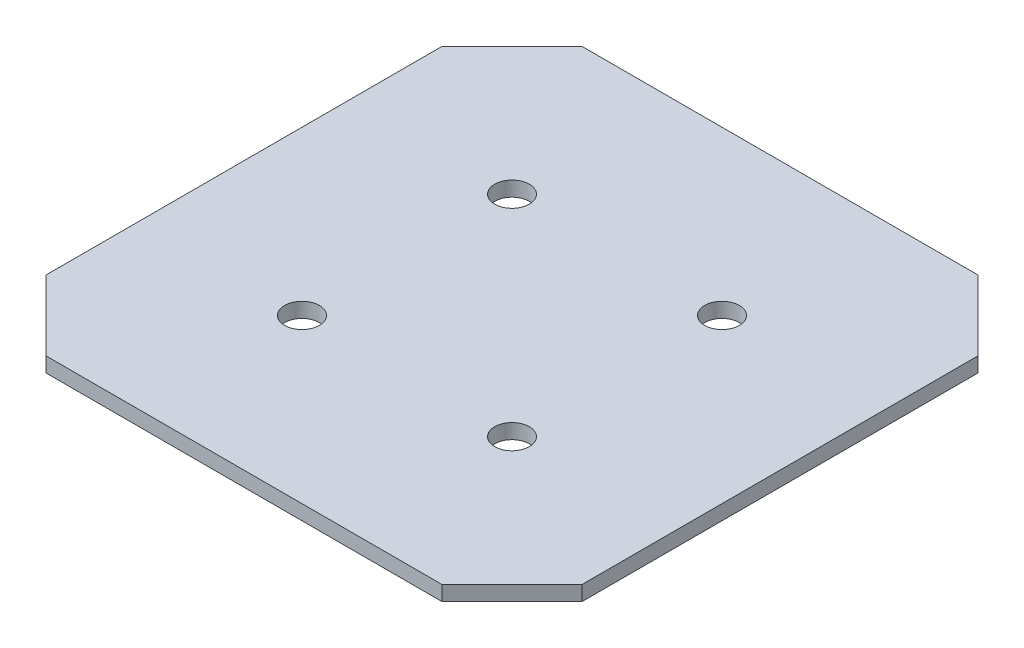
ISO-10303-21;
HEADER;
FILE_DESCRIPTION(('STEP AP214'),'2;1');
FILE_NAME('part.step','',(''),(''),'','','');
FILE_SCHEMA(('AUTOMOTIVE_DESIGN { 1 0 10303 214 1 1 1 1 }'));
ENDSEC;
DATA;
#1=APPLICATION_CONTEXT('core data for automotive mechanical design processes');
#2=APPLICATION_PROTOCOL_DEFINITION('international standard','automotive_design',2000,#1);
#3=PRODUCT_CONTEXT('',#1,'mechanical');
#4=PRODUCT('Part','Part','',(#3));
#5=PRODUCT_RELATED_PRODUCT_CATEGORY('part','',(#4));
#6=PRODUCT_DEFINITION_FORMATION('','',#4);
#7=PRODUCT_DEFINITION_CONTEXT('part definition',#1,'design');
#8=PRODUCT_DEFINITION('design','',#6,#7);
#9=PRODUCT_DEFINITION_SHAPE('','',#8);
#10=(LENGTH_UNIT() NAMED_UNIT(*) SI_UNIT(.MILLI.,.METRE.));
#11=(NAMED_UNIT(*) PLANE_ANGLE_UNIT() SI_UNIT($,.RADIAN.));
#12=(NAMED_UNIT(*) SI_UNIT($,.STERADIAN.) SOLID_ANGLE_UNIT());
#13=UNCERTAINTY_MEASURE_WITH_UNIT(LENGTH_MEASURE(1.E-05),#10,'distance_accuracy_value','');
#14=(GEOMETRIC_REPRESENTATION_CONTEXT(3) GLOBAL_UNCERTAINTY_ASSIGNED_CONTEXT((#13)) GLOBAL_UNIT_ASSIGNED_CONTEXT((#10,
#11,#12)) REPRESENTATION_CONTEXT('',''));
#15=CARTESIAN_POINT('',(0.,0.,0.));
#16=DIRECTION('',(0.,0.,1.));
#17=DIRECTION('',(1.,0.,0.));
#18=AXIS2_PLACEMENT_3D('',#15,#16,#17);
#19=CARTESIAN_POINT('',(0.,3.,0.));
#20=DIRECTION('',(0.,1.,0.));
#21=DIRECTION('',(0.,0.,1.));
#22=AXIS2_PLACEMENT_3D('',#19,#20,#21);
#23=PLANE('',#22);
#24=CARTESIAN_POINT('',(21.2132034355964,3.,21.2132034355965));
#25=DIRECTION('',(0.,1.,0.));
#26=DIRECTION('',(0.,0.,1.));
#27=AXIS2_PLACEMENT_3D('',#24,#25,#26);
#28=CIRCLE('',#27,3.5);
#29=CARTESIAN_POINT('',(21.2132034355964,3.,24.7132034355965));
#30=VERTEX_POINT('',#29);
#31=EDGE_CURVE('E221',#30,#30,#28,.T.);
#32=ORIENTED_EDGE('',*,*,#31,.F.);
#33=EDGE_LOOP('',(#32));
#34=FACE_BOUND('',#33,.T.);
#35=CARTESIAN_POINT('',(-21.2132034355965,3.,-21.2132034355964));
#36=DIRECTION('',(0.,1.,0.));
#37=DIRECTION('',(0.,0.,1.));
#38=AXIS2_PLACEMENT_3D('',#35,#36,#37);
#39=CIRCLE('',#38,3.5);
#40=CARTESIAN_POINT('',(-21.2132034355965,3.,-17.7132034355964));
#41=VERTEX_POINT('',#40);
#42=EDGE_CURVE('E146',#41,#41,#39,.T.);
#43=ORIENTED_EDGE('',*,*,#42,.F.);
#44=EDGE_LOOP('',(#43));
#45=FACE_BOUND('',#44,.T.);
#46=DIRECTION('',(0.,0.,1.));
#47=VECTOR('',#46,1.);
#48=CARTESIAN_POINT('',(-54.142135623731,3.,-39.9999999999999));
#49=LINE('',#48,#47);
#50=CARTESIAN_POINT('',(-54.142135623731,3.,-39.9999999999999));
#51=VERTEX_POINT('',#50);
#52=CARTESIAN_POINT('',(-54.142135623731,3.,40.0000000000001));
#53=VERTEX_POINT('',#52);
#54=EDGE_CURVE('E164',#51,#53,#49,.T.);
#55=ORIENTED_EDGE('',*,*,#54,.T.);
#56=DIRECTION('',(0.707106781186555,0.,0.70710678118654));
#57=VECTOR('',#56,1.);
#58=CARTESIAN_POINT('',(-54.142135623731,3.,40.0000000000001));
#59=LINE('',#58,#57);
#60=CARTESIAN_POINT('',(-39.9999999999999,3.,54.1421356237309));
#61=VERTEX_POINT('',#60);
#62=EDGE_CURVE('E100',#53,#61,#59,.T.);
#63=ORIENTED_EDGE('',*,*,#62,.T.);
#64=DIRECTION('',(1.,0.,0.));
#65=VECTOR('',#64,1.);
#66=CARTESIAN_POINT('',(-39.9999999999999,3.,54.1421356237309));
#67=LINE('',#66,#65);
#68=CARTESIAN_POINT('',(40.0000000000001,3.,54.1421356237309));
#69=VERTEX_POINT('',#68);
#70=EDGE_CURVE('E185',#61,#69,#67,.T.);
#71=ORIENTED_EDGE('',*,*,#70,.T.);
#72=DIRECTION('',(0.707106781186544,0.,-0.707106781186551));
#73=VECTOR('',#72,1.);
#74=CARTESIAN_POINT('',(40.0000000000001,3.,54.1421356237309));
#75=LINE('',#74,#73);
#76=CARTESIAN_POINT('',(54.142135623731,3.,39.9999999999999));
#77=VERTEX_POINT('',#76);
#78=EDGE_CURVE('E199',#69,#77,#75,.T.);
#79=ORIENTED_EDGE('',*,*,#78,.T.);
#80=DIRECTION('',(0.,0.,-1.));
#81=VECTOR('',#80,1.);
#82=CARTESIAN_POINT('',(54.142135623731,3.,-40.0000000000001));
#83=LINE('',#82,#81);
#84=CARTESIAN_POINT('',(54.142135623731,3.,-40.0000000000001));
#85=VERTEX_POINT('',#84);
#86=EDGE_CURVE('E119',#77,#85,#83,.T.);
#87=ORIENTED_EDGE('',*,*,#86,.T.);
#88=DIRECTION('',(-0.707106781186555,0.,-0.707106781186539));
#89=VECTOR('',#88,1.);
#90=CARTESIAN_POINT('',(39.9999999999999,3.,-54.1421356237309));
#91=LINE('',#90,#89);
#92=CARTESIAN_POINT('',(39.9999999999999,3.,-54.1421356237309));
#93=VERTEX_POINT('',#92);
#94=EDGE_CURVE('E113',#85,#93,#91,.T.);
#95=ORIENTED_EDGE('',*,*,#94,.T.);
#96=DIRECTION('',(-1.,0.,0.));
#97=VECTOR('',#96,1.);
#98=CARTESIAN_POINT('',(-40.0000000000001,3.,-54.1421356237309));
#99=LINE('',#98,#97);
#100=CARTESIAN_POINT('',(-40.0000000000001,3.,-54.1421356237309));
#101=VERTEX_POINT('',#100);
#102=EDGE_CURVE('E117',#93,#101,#99,.T.);
#103=ORIENTED_EDGE('',*,*,#102,.T.);
#104=DIRECTION('',(-0.707106781186544,0.,0.707106781186551));
#105=VECTOR('',#104,1.);
#106=CARTESIAN_POINT('',(-54.142135623731,3.,-39.9999999999999));
#107=LINE('',#106,#105);
#108=EDGE_CURVE('E57',#101,#51,#107,.T.);
#109=ORIENTED_EDGE('',*,*,#108,.T.);
#110=EDGE_LOOP('',(#55,#63,#71,#79,#87,#95,#103,#109));
#111=FACE_BOUND('',#110,.T.);
#112=CARTESIAN_POINT('',(21.2132034355964,3.,-21.2132034355965));
#113=DIRECTION('',(0.,1.,0.));
#114=DIRECTION('',(0.,0.,1.));
#115=AXIS2_PLACEMENT_3D('',#112,#113,#114);
#116=CIRCLE('',#115,3.5);
#117=CARTESIAN_POINT('',(21.2132034355964,3.,-17.7132034355965));
#118=VERTEX_POINT('',#117);
#119=EDGE_CURVE('E213',#118,#118,#116,.T.);
#120=ORIENTED_EDGE('',*,*,#119,.F.);
#121=EDGE_LOOP('',(#120));
#122=FACE_BOUND('',#121,.T.);
#123=CARTESIAN_POINT('',(-21.2132034355965,3.,21.2132034355964));
#124=DIRECTION('',(0.,1.,0.));
#125=DIRECTION('',(0.,0.,1.));
#126=AXIS2_PLACEMENT_3D('',#123,#124,#125);
#127=CIRCLE('',#126,3.5);
#128=CARTESIAN_POINT('',(-21.2132034355965,3.,24.7132034355964));
#129=VERTEX_POINT('',#128);
#130=EDGE_CURVE('E229',#129,#129,#127,.T.);
#131=ORIENTED_EDGE('',*,*,#130,.F.);
#132=EDGE_LOOP('',(#131));
#133=FACE_BOUND('',#132,.T.);
#134=ADVANCED_FACE('F39',(#34,#45,#111,#122,#133),#23,.T.);
#135=CARTESIAN_POINT('',(0.,0.,0.));
#136=DIRECTION('',(0.,1.,0.));
#137=DIRECTION('',(0.,0.,1.));
#138=AXIS2_PLACEMENT_3D('',#135,#136,#137);
#139=PLANE('',#138);
#140=DIRECTION('',(0.,0.,1.));
#141=VECTOR('',#140,1.);
#142=CARTESIAN_POINT('',(-54.142135623731,0.,-39.9999999999999));
#143=LINE('',#142,#141);
#144=CARTESIAN_POINT('',(-54.142135623731,0.,-39.9999999999999));
#145=VERTEX_POINT('',#144);
#146=CARTESIAN_POINT('',(-54.142135623731,0.,40.0000000000001));
#147=VERTEX_POINT('',#146);
#148=EDGE_CURVE('E141',#145,#147,#143,.T.);
#149=ORIENTED_EDGE('',*,*,#148,.F.);
#150=DIRECTION('',(-0.707106781186544,0.,0.707106781186551));
#151=VECTOR('',#150,1.);
#152=CARTESIAN_POINT('',(-54.142135623731,0.,-39.9999999999999));
#153=LINE('',#152,#151);
#154=CARTESIAN_POINT('',(-40.0000000000001,0.,-54.1421356237309));
#155=VERTEX_POINT('',#154);
#156=EDGE_CURVE('E92',#155,#145,#153,.T.);
#157=ORIENTED_EDGE('',*,*,#156,.F.);
#158=DIRECTION('',(-1.,0.,0.));
#159=VECTOR('',#158,1.);
#160=CARTESIAN_POINT('',(-40.0000000000001,0.,-54.1421356237309));
#161=LINE('',#160,#159);
#162=CARTESIAN_POINT('',(39.9999999999999,0.,-54.1421356237309));
#163=VERTEX_POINT('',#162);
#164=EDGE_CURVE('E86',#163,#155,#161,.T.);
#165=ORIENTED_EDGE('',*,*,#164,.F.);
#166=DIRECTION('',(-0.707106781186555,0.,-0.707106781186539));
#167=VECTOR('',#166,1.);
#168=CARTESIAN_POINT('',(39.9999999999999,0.,-54.1421356237309));
#169=LINE('',#168,#167);
#170=CARTESIAN_POINT('',(54.142135623731,0.,-40.0000000000001));
#171=VERTEX_POINT('',#170);
#172=EDGE_CURVE('E128',#171,#163,#169,.T.);
#173=ORIENTED_EDGE('',*,*,#172,.F.);
#174=DIRECTION('',(0.,0.,-1.));
#175=VECTOR('',#174,1.);
#176=CARTESIAN_POINT('',(54.142135623731,0.,-40.0000000000001));
#177=LINE('',#176,#175);
#178=CARTESIAN_POINT('',(54.142135623731,0.,39.9999999999999));
#179=VERTEX_POINT('',#178);
#180=EDGE_CURVE('E155',#179,#171,#177,.T.);
#181=ORIENTED_EDGE('',*,*,#180,.F.);
#182=DIRECTION('',(0.707106781186544,0.,-0.707106781186551));
#183=VECTOR('',#182,1.);
#184=CARTESIAN_POINT('',(40.0000000000001,0.,54.1421356237309));
#185=LINE('',#184,#183);
#186=CARTESIAN_POINT('',(40.0000000000001,0.,54.1421356237309));
#187=VERTEX_POINT('',#186);
#188=EDGE_CURVE('E152',#187,#179,#185,.T.);
#189=ORIENTED_EDGE('',*,*,#188,.F.);
#190=DIRECTION('',(1.,0.,0.));
#191=VECTOR('',#190,1.);
#192=CARTESIAN_POINT('',(-39.9999999999999,0.,54.1421356237309));
#193=LINE('',#192,#191);
#194=CARTESIAN_POINT('',(-39.9999999999999,0.,54.1421356237309));
#195=VERTEX_POINT('',#194);
#196=EDGE_CURVE('E149',#195,#187,#193,.T.);
#197=ORIENTED_EDGE('',*,*,#196,.F.);
#198=DIRECTION('',(0.707106781186555,0.,0.70710678118654));
#199=VECTOR('',#198,1.);
#200=CARTESIAN_POINT('',(-54.142135623731,0.,40.0000000000001));
#201=LINE('',#200,#199);
#202=EDGE_CURVE('E145',#147,#195,#201,.T.);
#203=ORIENTED_EDGE('',*,*,#202,.F.);
#204=EDGE_LOOP('',(#149,#157,#165,#173,#181,#189,#197,#203));
#205=FACE_BOUND('',#204,.T.);
#206=CARTESIAN_POINT('',(-21.2132034355965,0.,-21.2132034355964));
#207=DIRECTION('',(0.,1.,0.));
#208=DIRECTION('',(0.,0.,1.));
#209=AXIS2_PLACEMENT_3D('',#206,#207,#208);
#210=CIRCLE('',#209,3.5);
#211=CARTESIAN_POINT('',(-21.2132034355965,0.,-17.7132034355964));
#212=VERTEX_POINT('',#211);
#213=EDGE_CURVE('E209',#212,#212,#210,.T.);
#214=ORIENTED_EDGE('',*,*,#213,.T.);
#215=EDGE_LOOP('',(#214));
#216=FACE_BOUND('',#215,.T.);
#217=CARTESIAN_POINT('',(21.2132034355964,0.,-21.2132034355965));
#218=DIRECTION('',(0.,1.,0.));
#219=DIRECTION('',(0.,0.,1.));
#220=AXIS2_PLACEMENT_3D('',#217,#218,#219);
#221=CIRCLE('',#220,3.5);
#222=CARTESIAN_POINT('',(21.2132034355964,0.,-17.7132034355965));
#223=VERTEX_POINT('',#222);
#224=EDGE_CURVE('E217',#223,#223,#221,.T.);
#225=ORIENTED_EDGE('',*,*,#224,.T.);
#226=EDGE_LOOP('',(#225));
#227=FACE_BOUND('',#226,.T.);
#228=CARTESIAN_POINT('',(21.2132034355964,0.,21.2132034355965));
#229=DIRECTION('',(0.,1.,0.));
#230=DIRECTION('',(0.,0.,1.));
#231=AXIS2_PLACEMENT_3D('',#228,#229,#230);
#232=CIRCLE('',#231,3.5);
#233=CARTESIAN_POINT('',(21.2132034355964,0.,24.7132034355965));
#234=VERTEX_POINT('',#233);
#235=EDGE_CURVE('E225',#234,#234,#232,.T.);
#236=ORIENTED_EDGE('',*,*,#235,.T.);
#237=EDGE_LOOP('',(#236));
#238=FACE_BOUND('',#237,.T.);
#239=CARTESIAN_POINT('',(-21.2132034355965,0.,21.2132034355964));
#240=DIRECTION('',(0.,1.,0.));
#241=DIRECTION('',(0.,0.,1.));
#242=AXIS2_PLACEMENT_3D('',#239,#240,#241);
#243=CIRCLE('',#242,3.5);
#244=CARTESIAN_POINT('',(-21.2132034355965,0.,24.7132034355964));
#245=VERTEX_POINT('',#244);
#246=EDGE_CURVE('E233',#245,#245,#243,.T.);
#247=ORIENTED_EDGE('',*,*,#246,.T.);
#248=EDGE_LOOP('',(#247));
#249=FACE_BOUND('',#248,.T.);
#250=ADVANCED_FACE('F189',(#205,#216,#227,#238,#249),#139,.F.);
#251=CARTESIAN_POINT('',(-54.142135623731,3.,-39.9999999999999));
#252=DIRECTION('',(1.,0.,0.));
#253=DIRECTION('',(0.,0.,-1.));
#254=AXIS2_PLACEMENT_3D('',#251,#252,#253);
#255=PLANE('',#254);
#256=ORIENTED_EDGE('',*,*,#148,.T.);
#257=DIRECTION('',(0.,-1.,0.));
#258=VECTOR('',#257,1.);
#259=CARTESIAN_POINT('',(-54.142135623731,3.,40.0000000000001));
#260=LINE('',#259,#258);
#261=EDGE_CURVE('E11',#53,#147,#260,.T.);
#262=ORIENTED_EDGE('',*,*,#261,.F.);
#263=ORIENTED_EDGE('',*,*,#54,.F.);
#264=DIRECTION('',(0.,-1.,0.));
#265=VECTOR('',#264,1.);
#266=CARTESIAN_POINT('',(-54.142135623731,3.,-39.9999999999999));
#267=LINE('',#266,#265);
#268=EDGE_CURVE('E137',#51,#145,#267,.T.);
#269=ORIENTED_EDGE('',*,*,#268,.T.);
#270=EDGE_LOOP('',(#256,#262,#263,#269));
#271=FACE_BOUND('',#270,.T.);
#272=ADVANCED_FACE('F41',(#271),#255,.F.);
#273=CARTESIAN_POINT('',(-54.142135623731,3.,40.0000000000001));
#274=DIRECTION('',(0.70710678118654,0.,-0.707106781186555));
#275=DIRECTION('',(-0.707106781186555,0.,-0.70710678118654));
#276=AXIS2_PLACEMENT_3D('',#273,#274,#275);
#277=PLANE('',#276);
#278=ORIENTED_EDGE('',*,*,#202,.T.);
#279=DIRECTION('',(0.,-1.,0.));
#280=VECTOR('',#279,1.);
#281=CARTESIAN_POINT('',(-39.9999999999999,3.,54.1421356237309));
#282=LINE('',#281,#280);
#283=EDGE_CURVE('E49',#61,#195,#282,.T.);
#284=ORIENTED_EDGE('',*,*,#283,.F.);
#285=ORIENTED_EDGE('',*,*,#62,.F.);
#286=ORIENTED_EDGE('',*,*,#261,.T.);
#287=EDGE_LOOP('',(#278,#284,#285,#286));
#288=FACE_BOUND('',#287,.T.);
#289=ADVANCED_FACE('F269',(#288),#277,.F.);
#290=CARTESIAN_POINT('',(-39.9999999999999,3.,54.1421356237309));
#291=DIRECTION('',(0.,0.,-1.));
#292=DIRECTION('',(-1.,0.,0.));
#293=AXIS2_PLACEMENT_3D('',#290,#291,#292);
#294=PLANE('',#293);
#295=ORIENTED_EDGE('',*,*,#196,.T.);
#296=DIRECTION('',(0.,-1.,0.));
#297=VECTOR('',#296,1.);
#298=CARTESIAN_POINT('',(40.0000000000001,3.,54.1421356237309));
#299=LINE('',#298,#297);
#300=EDGE_CURVE('E175',#69,#187,#299,.T.);
#301=ORIENTED_EDGE('',*,*,#300,.F.);
#302=ORIENTED_EDGE('',*,*,#70,.F.);
#303=ORIENTED_EDGE('',*,*,#283,.T.);
#304=EDGE_LOOP('',(#295,#301,#302,#303));
#305=FACE_BOUND('',#304,.T.);
#306=ADVANCED_FACE('F183',(#305),#294,.F.);
#307=CARTESIAN_POINT('',(40.0000000000001,3.,54.1421356237309));
#308=DIRECTION('',(-0.707106781186551,0.,-0.707106781186544));
#309=DIRECTION('',(-0.707106781186544,0.,0.707106781186551));
#310=AXIS2_PLACEMENT_3D('',#307,#308,#309);
#311=PLANE('',#310);
#312=ORIENTED_EDGE('',*,*,#188,.T.);
#313=DIRECTION('',(0.,-1.,0.));
#314=VECTOR('',#313,1.);
#315=CARTESIAN_POINT('',(54.142135623731,3.,39.9999999999999));
#316=LINE('',#315,#314);
#317=EDGE_CURVE('E171',#77,#179,#316,.T.);
#318=ORIENTED_EDGE('',*,*,#317,.F.);
#319=ORIENTED_EDGE('',*,*,#78,.F.);
#320=ORIENTED_EDGE('',*,*,#300,.T.);
#321=EDGE_LOOP('',(#312,#318,#319,#320));
#322=FACE_BOUND('',#321,.T.);
#323=ADVANCED_FACE('F194',(#322),#311,.F.);
#324=CARTESIAN_POINT('',(54.142135623731,3.,-40.0000000000001));
#325=DIRECTION('',(-1.,0.,0.));
#326=DIRECTION('',(0.,0.,1.));
#327=AXIS2_PLACEMENT_3D('',#324,#325,#326);
#328=PLANE('',#327);
#329=ORIENTED_EDGE('',*,*,#180,.T.);
#330=DIRECTION('',(0.,-1.,0.));
#331=VECTOR('',#330,1.);
#332=CARTESIAN_POINT('',(54.142135623731,3.,-40.0000000000001));
#333=LINE('',#332,#331);
#334=EDGE_CURVE('E130',#85,#171,#333,.T.);
#335=ORIENTED_EDGE('',*,*,#334,.F.);
#336=ORIENTED_EDGE('',*,*,#86,.F.);
#337=ORIENTED_EDGE('',*,*,#317,.T.);
#338=EDGE_LOOP('',(#329,#335,#336,#337));
#339=FACE_BOUND('',#338,.T.);
#340=ADVANCED_FACE('F197',(#339),#328,.F.);
#341=CARTESIAN_POINT('',(39.9999999999999,3.,-54.1421356237309));
#342=DIRECTION('',(-0.70710678118654,0.,0.707106781186555));
#343=DIRECTION('',(0.707106781186555,0.,0.70710678118654));
#344=AXIS2_PLACEMENT_3D('',#341,#342,#343);
#345=PLANE('',#344);
#346=ORIENTED_EDGE('',*,*,#172,.T.);
#347=DIRECTION('',(0.,-1.,0.));
#348=VECTOR('',#347,1.);
#349=CARTESIAN_POINT('',(39.9999999999999,3.,-54.1421356237309));
#350=LINE('',#349,#348);
#351=EDGE_CURVE('E125',#93,#163,#350,.T.);
#352=ORIENTED_EDGE('',*,*,#351,.F.);
#353=ORIENTED_EDGE('',*,*,#94,.F.);
#354=ORIENTED_EDGE('',*,*,#334,.T.);
#355=EDGE_LOOP('',(#346,#352,#353,#354));
#356=FACE_BOUND('',#355,.T.);
#357=ADVANCED_FACE('F126',(#356),#345,.F.);
#358=CARTESIAN_POINT('',(-40.0000000000001,3.,-54.1421356237309));
#359=DIRECTION('',(0.,0.,1.));
#360=DIRECTION('',(1.,0.,0.));
#361=AXIS2_PLACEMENT_3D('',#358,#359,#360);
#362=PLANE('',#361);
#363=ORIENTED_EDGE('',*,*,#164,.T.);
#364=DIRECTION('',(0.,-1.,0.));
#365=VECTOR('',#364,1.);
#366=CARTESIAN_POINT('',(-40.0000000000001,3.,-54.1421356237309));
#367=LINE('',#366,#365);
#368=EDGE_CURVE('E131',#101,#155,#367,.T.);
#369=ORIENTED_EDGE('',*,*,#368,.F.);
#370=ORIENTED_EDGE('',*,*,#102,.F.);
#371=ORIENTED_EDGE('',*,*,#351,.T.);
#372=EDGE_LOOP('',(#363,#369,#370,#371));
#373=FACE_BOUND('',#372,.T.);
#374=ADVANCED_FACE('F133',(#373),#362,.F.);
#375=CARTESIAN_POINT('',(-54.142135623731,3.,-39.9999999999999));
#376=DIRECTION('',(0.707106781186551,0.,0.707106781186544));
#377=DIRECTION('',(0.707106781186544,0.,-0.707106781186551));
#378=AXIS2_PLACEMENT_3D('',#375,#376,#377);
#379=PLANE('',#378);
#380=ORIENTED_EDGE('',*,*,#156,.T.);
#381=ORIENTED_EDGE('',*,*,#268,.F.);
#382=ORIENTED_EDGE('',*,*,#108,.F.);
#383=ORIENTED_EDGE('',*,*,#368,.T.);
#384=EDGE_LOOP('',(#380,#381,#382,#383));
#385=FACE_BOUND('',#384,.T.);
#386=ADVANCED_FACE('F257',(#385),#379,.F.);
#387=CARTESIAN_POINT('',(-21.2132034355965,3.,-21.2132034355964));
#388=DIRECTION('',(0.,-1.,0.));
#389=DIRECTION('',(0.,0.,-1.));
#390=AXIS2_PLACEMENT_3D('',#387,#388,#389);
#391=CYLINDRICAL_SURFACE('',#390,3.5);
#392=ORIENTED_EDGE('',*,*,#42,.T.);
#393=EDGE_LOOP('',(#392));
#394=FACE_BOUND('',#393,.T.);
#395=ORIENTED_EDGE('',*,*,#213,.F.);
#396=EDGE_LOOP('',(#395));
#397=FACE_BOUND('',#396,.T.);
#398=ADVANCED_FACE('F254',(#394,#397),#391,.F.);
#399=CARTESIAN_POINT('',(21.2132034355964,3.,-21.2132034355965));
#400=DIRECTION('',(0.,-1.,0.));
#401=DIRECTION('',(0.,0.,-1.));
#402=AXIS2_PLACEMENT_3D('',#399,#400,#401);
#403=CYLINDRICAL_SURFACE('',#402,3.5);
#404=ORIENTED_EDGE('',*,*,#119,.T.);
#405=EDGE_LOOP('',(#404));
#406=FACE_BOUND('',#405,.T.);
#407=ORIENTED_EDGE('',*,*,#224,.F.);
#408=EDGE_LOOP('',(#407));
#409=FACE_BOUND('',#408,.T.);
#410=ADVANCED_FACE('F333',(#406,#409),#403,.F.);
#411=CARTESIAN_POINT('',(21.2132034355964,3.,21.2132034355965));
#412=DIRECTION('',(0.,-1.,0.));
#413=DIRECTION('',(0.,0.,-1.));
#414=AXIS2_PLACEMENT_3D('',#411,#412,#413);
#415=CYLINDRICAL_SURFACE('',#414,3.5);
#416=ORIENTED_EDGE('',*,*,#31,.T.);
#417=EDGE_LOOP('',(#416));
#418=FACE_BOUND('',#417,.T.);
#419=ORIENTED_EDGE('',*,*,#235,.F.);
#420=EDGE_LOOP('',(#419));
#421=FACE_BOUND('',#420,.T.);
#422=ADVANCED_FACE('F341',(#418,#421),#415,.F.);
#423=CARTESIAN_POINT('',(-21.2132034355965,3.,21.2132034355964));
#424=DIRECTION('',(0.,-1.,0.));
#425=DIRECTION('',(0.,0.,-1.));
#426=AXIS2_PLACEMENT_3D('',#423,#424,#425);
#427=CYLINDRICAL_SURFACE('',#426,3.5);
#428=ORIENTED_EDGE('',*,*,#130,.T.);
#429=EDGE_LOOP('',(#428));
#430=FACE_BOUND('',#429,.T.);
#431=ORIENTED_EDGE('',*,*,#246,.F.);
#432=EDGE_LOOP('',(#431));
#433=FACE_BOUND('',#432,.T.);
#434=ADVANCED_FACE('F241',(#430,#433),#427,.F.);
#435=CLOSED_SHELL('',(#134,#250,#272,#289,#306,#323,#340,#357,#374,#386,#398,#410,#422,#434));
#436=MANIFOLD_SOLID_BREP('B2',#435);
#437=ADVANCED_BREP_SHAPE_REPRESENTATION('',(#18,#436),#14);
#438=SHAPE_DEFINITION_REPRESENTATION(#9,#437);
ENDSEC;
END-ISO-10303-21;
